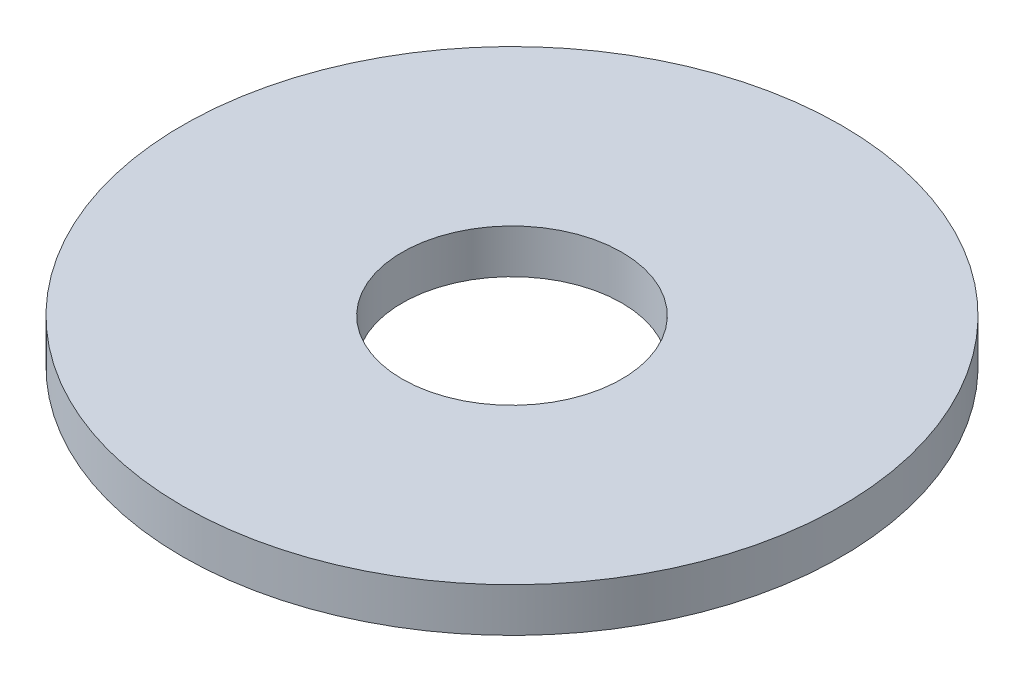
ISO-10303-21;
HEADER;
FILE_DESCRIPTION(('STEP AP214'),'2;1');
FILE_NAME('part.step','',(''),(''),'','','');
FILE_SCHEMA(('AUTOMOTIVE_DESIGN { 1 0 10303 214 1 1 1 1 }'));
ENDSEC;
DATA;
#1=APPLICATION_CONTEXT('core data for automotive mechanical design processes');
#2=APPLICATION_PROTOCOL_DEFINITION('international standard','automotive_design',2000,#1);
#3=PRODUCT_CONTEXT('',#1,'mechanical');
#4=PRODUCT('Part','Part','',(#3));
#5=PRODUCT_RELATED_PRODUCT_CATEGORY('part','',(#4));
#6=PRODUCT_DEFINITION_FORMATION('','',#4);
#7=PRODUCT_DEFINITION_CONTEXT('part definition',#1,'design');
#8=PRODUCT_DEFINITION('design','',#6,#7);
#9=PRODUCT_DEFINITION_SHAPE('','',#8);
#10=(LENGTH_UNIT() NAMED_UNIT(*) SI_UNIT(.MILLI.,.METRE.));
#11=(NAMED_UNIT(*) PLANE_ANGLE_UNIT() SI_UNIT($,.RADIAN.));
#12=(NAMED_UNIT(*) SI_UNIT($,.STERADIAN.) SOLID_ANGLE_UNIT());
#13=UNCERTAINTY_MEASURE_WITH_UNIT(LENGTH_MEASURE(1.E-05),#10,'distance_accuracy_value','');
#14=(GEOMETRIC_REPRESENTATION_CONTEXT(3) GLOBAL_UNCERTAINTY_ASSIGNED_CONTEXT((#13)) GLOBAL_UNIT_ASSIGNED_CONTEXT((#10,
#11,#12)) REPRESENTATION_CONTEXT('',''));
#15=CARTESIAN_POINT('',(0.,0.,0.));
#16=DIRECTION('',(0.,0.,1.));
#17=DIRECTION('',(1.,0.,0.));
#18=AXIS2_PLACEMENT_3D('',#15,#16,#17);
#19=CARTESIAN_POINT('',(0.,4.,0.));
#20=DIRECTION('',(0.,-1.,0.));
#21=DIRECTION('',(0.,0.,-1.));
#22=AXIS2_PLACEMENT_3D('',#19,#20,#21);
#23=CYLINDRICAL_SURFACE('',#22,30.);
#24=CARTESIAN_POINT('',(0.,4.,0.));
#25=DIRECTION('',(0.,1.,0.));
#26=DIRECTION('',(0.,0.,1.));
#27=AXIS2_PLACEMENT_3D('',#24,#25,#26);
#28=CIRCLE('',#27,30.);
#29=CARTESIAN_POINT('',(0.,4.,30.));
#30=VERTEX_POINT('',#29);
#31=EDGE_CURVE('E10',#30,#30,#28,.T.);
#32=ORIENTED_EDGE('',*,*,#31,.F.);
#33=EDGE_LOOP('',(#32));
#34=FACE_BOUND('',#33,.T.);
#35=CARTESIAN_POINT('',(0.,0.,0.));
#36=DIRECTION('',(0.,1.,0.));
#37=DIRECTION('',(0.,0.,1.));
#38=AXIS2_PLACEMENT_3D('',#35,#36,#37);
#39=CIRCLE('',#38,30.);
#40=CARTESIAN_POINT('',(0.,0.,30.));
#41=VERTEX_POINT('',#40);
#42=EDGE_CURVE('E45',#41,#41,#39,.T.);
#43=ORIENTED_EDGE('',*,*,#42,.T.);
#44=EDGE_LOOP('',(#43));
#45=FACE_BOUND('',#44,.T.);
#46=ADVANCED_FACE('F37',(#34,#45),#23,.T.);
#47=CARTESIAN_POINT('',(0.,4.,0.));
#48=DIRECTION('',(0.,1.,0.));
#49=DIRECTION('',(0.,0.,1.));
#50=AXIS2_PLACEMENT_3D('',#47,#48,#49);
#51=PLANE('',#50);
#52=CARTESIAN_POINT('',(0.,4.,0.));
#53=DIRECTION('',(0.,1.,0.));
#54=DIRECTION('',(0.,0.,1.));
#55=AXIS2_PLACEMENT_3D('',#52,#53,#54);
#56=CIRCLE('',#55,10.);
#57=CARTESIAN_POINT('',(0.,4.,10.));
#58=VERTEX_POINT('',#57);
#59=EDGE_CURVE('E52',#58,#58,#56,.T.);
#60=ORIENTED_EDGE('',*,*,#59,.F.);
#61=EDGE_LOOP('',(#60));
#62=FACE_BOUND('',#61,.T.);
#63=ORIENTED_EDGE('',*,*,#31,.T.);
#64=EDGE_LOOP('',(#63));
#65=FACE_BOUND('',#64,.T.);
#66=ADVANCED_FACE('F70',(#62,#65),#51,.T.);
#67=CARTESIAN_POINT('',(0.,0.,0.));
#68=DIRECTION('',(0.,1.,0.));
#69=DIRECTION('',(0.,0.,1.));
#70=AXIS2_PLACEMENT_3D('',#67,#68,#69);
#71=PLANE('',#70);
#72=CARTESIAN_POINT('',(0.,0.,0.));
#73=DIRECTION('',(0.,1.,0.));
#74=DIRECTION('',(0.,0.,1.));
#75=AXIS2_PLACEMENT_3D('',#72,#73,#74);
#76=CIRCLE('',#75,10.);
#77=CARTESIAN_POINT('',(0.,0.,10.));
#78=VERTEX_POINT('',#77);
#79=EDGE_CURVE('E40',#78,#78,#76,.T.);
#80=ORIENTED_EDGE('',*,*,#79,.T.);
#81=EDGE_LOOP('',(#80));
#82=FACE_BOUND('',#81,.T.);
#83=ORIENTED_EDGE('',*,*,#42,.F.);
#84=EDGE_LOOP('',(#83));
#85=FACE_BOUND('',#84,.T.);
#86=ADVANCED_FACE('F61',(#82,#85),#71,.F.);
#87=CARTESIAN_POINT('',(0.,-6.,0.));
#88=DIRECTION('',(0.,1.,0.));
#89=DIRECTION('',(0.,0.,1.));
#90=AXIS2_PLACEMENT_3D('',#87,#88,#89);
#91=CYLINDRICAL_SURFACE('',#90,10.);
#92=ORIENTED_EDGE('',*,*,#59,.T.);
#93=EDGE_LOOP('',(#92));
#94=FACE_BOUND('',#93,.T.);
#95=ORIENTED_EDGE('',*,*,#79,.F.);
#96=EDGE_LOOP('',(#95));
#97=FACE_BOUND('',#96,.T.);
#98=ADVANCED_FACE('F64',(#94,#97),#91,.F.);
#99=CLOSED_SHELL('',(#46,#66,#86,#98));
#100=MANIFOLD_SOLID_BREP('B2',#99);
#101=ADVANCED_BREP_SHAPE_REPRESENTATION('',(#18,#100),#14);
#102=SHAPE_DEFINITION_REPRESENTATION(#9,#101);
ENDSEC;
END-ISO-10303-21;
